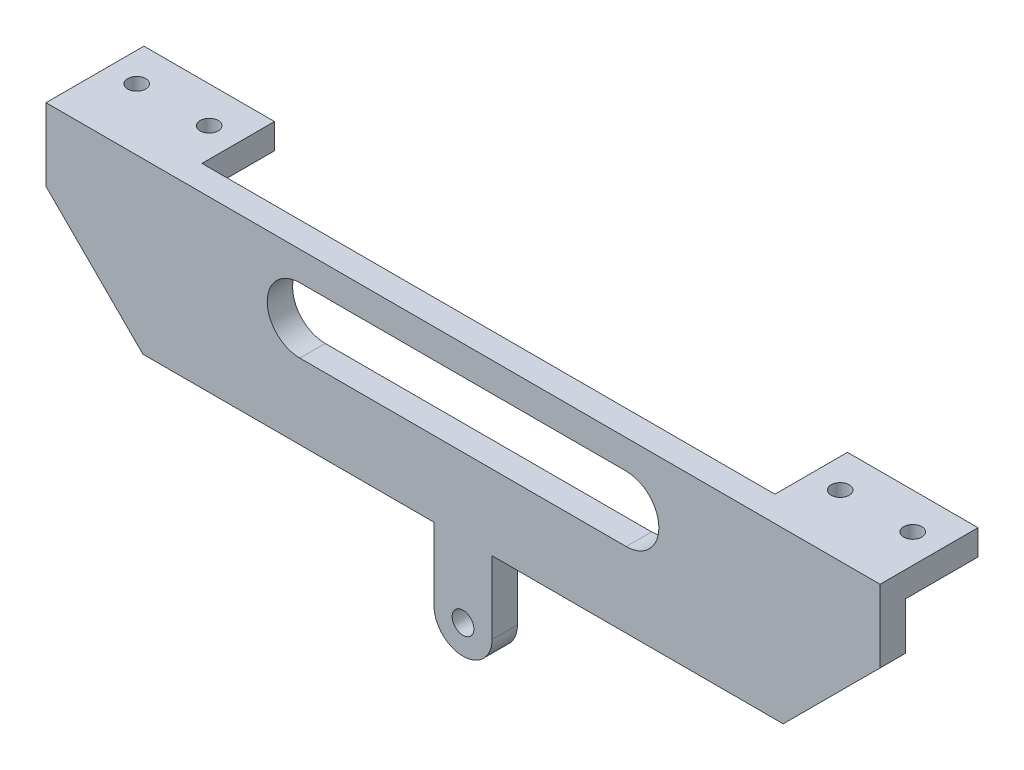
ISO-10303-21;
HEADER;
FILE_DESCRIPTION(('STEP AP214'),'2;1');
FILE_NAME('part.step','',(''),(''),'','','');
FILE_SCHEMA(('AUTOMOTIVE_DESIGN { 1 0 10303 214 1 1 1 1 }'));
ENDSEC;
DATA;
#1=APPLICATION_CONTEXT('core data for automotive mechanical design processes');
#2=APPLICATION_PROTOCOL_DEFINITION('international standard','automotive_design',2000,#1);
#3=PRODUCT_CONTEXT('',#1,'mechanical');
#4=PRODUCT('Part','Part','',(#3));
#5=PRODUCT_RELATED_PRODUCT_CATEGORY('part','',(#4));
#6=PRODUCT_DEFINITION_FORMATION('','',#4);
#7=PRODUCT_DEFINITION_CONTEXT('part definition',#1,'design');
#8=PRODUCT_DEFINITION('design','',#6,#7);
#9=PRODUCT_DEFINITION_SHAPE('','',#8);
#10=(LENGTH_UNIT() NAMED_UNIT(*) SI_UNIT(.MILLI.,.METRE.));
#11=(NAMED_UNIT(*) PLANE_ANGLE_UNIT() SI_UNIT($,.RADIAN.));
#12=(NAMED_UNIT(*) SI_UNIT($,.STERADIAN.) SOLID_ANGLE_UNIT());
#13=UNCERTAINTY_MEASURE_WITH_UNIT(LENGTH_MEASURE(1.E-05),#10,'distance_accuracy_value','');
#14=(GEOMETRIC_REPRESENTATION_CONTEXT(3) GLOBAL_UNCERTAINTY_ASSIGNED_CONTEXT((#13)) GLOBAL_UNIT_ASSIGNED_CONTEXT((#10,
#11,#12)) REPRESENTATION_CONTEXT('',''));
#15=CARTESIAN_POINT('',(0.,0.,0.));
#16=DIRECTION('',(0.,0.,1.));
#17=DIRECTION('',(1.,0.,0.));
#18=AXIS2_PLACEMENT_3D('',#15,#16,#17);
#19=CARTESIAN_POINT('',(0.,60.,0.));
#20=DIRECTION('',(0.,0.,1.));
#21=DIRECTION('',(1.,0.,0.));
#22=AXIS2_PLACEMENT_3D('',#19,#20,#21);
#23=PLANE('',#22);
#24=CARTESIAN_POINT('',(0.,60.,0.));
#25=DIRECTION('',(0.,0.,1.));
#26=DIRECTION('',(1.,0.,0.));
#27=AXIS2_PLACEMENT_3D('',#24,#25,#26);
#28=CIRCLE('',#27,1.5);
#29=CARTESIAN_POINT('',(1.50000000000002,60.,0.));
#30=VERTEX_POINT('',#29);
#31=EDGE_CURVE('E351',#30,#30,#28,.T.);
#32=ORIENTED_EDGE('',*,*,#31,.T.);
#33=EDGE_LOOP('',(#32));
#34=FACE_BOUND('',#33,.T.);
#35=CARTESIAN_POINT('',(-22.5,84.85,0.));
#36=DIRECTION('',(0.,0.,1.));
#37=DIRECTION('',(1.,0.,0.));
#38=AXIS2_PLACEMENT_3D('',#35,#36,#37);
#39=CIRCLE('',#38,4.5);
#40=CARTESIAN_POINT('',(-22.5,89.35,0.));
#41=VERTEX_POINT('',#40);
#42=CARTESIAN_POINT('',(-22.5,80.35,0.));
#43=VERTEX_POINT('',#42);
#44=EDGE_CURVE('E335',#41,#43,#39,.T.);
#45=ORIENTED_EDGE('',*,*,#44,.T.);
#46=DIRECTION('',(1.,0.,0.));
#47=VECTOR('',#46,1.);
#48=CARTESIAN_POINT('',(-22.5,80.35,0.));
#49=LINE('',#48,#47);
#50=CARTESIAN_POINT('',(22.5,80.3500000000001,0.));
#51=VERTEX_POINT('',#50);
#52=EDGE_CURVE('E331',#43,#51,#49,.T.);
#53=ORIENTED_EDGE('',*,*,#52,.T.);
#54=CARTESIAN_POINT('',(22.5,84.85,0.));
#55=DIRECTION('',(0.,0.,1.));
#56=DIRECTION('',(1.,0.,0.));
#57=AXIS2_PLACEMENT_3D('',#54,#55,#56);
#58=CIRCLE('',#57,4.49999999999998);
#59=CARTESIAN_POINT('',(22.5,89.35,0.));
#60=VERTEX_POINT('',#59);
#61=EDGE_CURVE('E327',#51,#60,#58,.T.);
#62=ORIENTED_EDGE('',*,*,#61,.T.);
#63=DIRECTION('',(-1.,0.,0.));
#64=VECTOR('',#63,1.);
#65=CARTESIAN_POINT('',(22.5,89.35,0.));
#66=LINE('',#65,#64);
#67=EDGE_CURVE('E322',#60,#41,#66,.T.);
#68=ORIENTED_EDGE('',*,*,#67,.T.);
#69=EDGE_LOOP('',(#45,#53,#62,#68));
#70=FACE_BOUND('',#69,.T.);
#71=DIRECTION('',(-1.,0.,0.));
#72=VECTOR('',#71,1.);
#73=CARTESIAN_POINT('',(-57.5,93.35,0.));
#74=LINE('',#73,#72);
#75=CARTESIAN_POINT('',(39.5,93.35,0.));
#76=VERTEX_POINT('',#75);
#77=CARTESIAN_POINT('',(-39.5,93.35,0.));
#78=VERTEX_POINT('',#77);
#79=EDGE_CURVE('E62',#76,#78,#74,.T.);
#80=ORIENTED_EDGE('',*,*,#79,.F.);
#81=DIRECTION('',(0.,1.,0.));
#82=VECTOR('',#81,1.);
#83=CARTESIAN_POINT('',(39.5,89.85,0.));
#84=LINE('',#83,#82);
#85=CARTESIAN_POINT('',(39.5,89.85,0.));
#86=VERTEX_POINT('',#85);
#87=EDGE_CURVE('E199',#86,#76,#84,.T.);
#88=ORIENTED_EDGE('',*,*,#87,.F.);
#89=DIRECTION('',(-1.,0.,0.));
#90=VECTOR('',#89,1.);
#91=CARTESIAN_POINT('',(0.,89.85,0.));
#92=LINE('',#91,#90);
#93=CARTESIAN_POINT('',(57.5,89.85,0.));
#94=VERTEX_POINT('',#93);
#95=EDGE_CURVE('E185',#94,#86,#92,.T.);
#96=ORIENTED_EDGE('',*,*,#95,.F.);
#97=DIRECTION('',(0.,1.,0.));
#98=VECTOR('',#97,1.);
#99=CARTESIAN_POINT('',(57.5,93.35,0.));
#100=LINE('',#99,#98);
#101=CARTESIAN_POINT('',(57.5,83.35,0.));
#102=VERTEX_POINT('',#101);
#103=EDGE_CURVE('E198',#102,#94,#100,.T.);
#104=ORIENTED_EDGE('',*,*,#103,.F.);
#105=DIRECTION('',(0.707314964616464,0.70689853644608,0.));
#106=VECTOR('',#105,1.);
#107=CARTESIAN_POINT('',(57.5,83.35,0.));
#108=LINE('',#107,#106);
#109=CARTESIAN_POINT('',(44.142135623731,70.,0.));
#110=VERTEX_POINT('',#109);
#111=EDGE_CURVE('E209',#110,#102,#108,.T.);
#112=ORIENTED_EDGE('',*,*,#111,.F.);
#113=DIRECTION('',(1.,0.,0.));
#114=VECTOR('',#113,1.);
#115=CARTESIAN_POINT('',(4.00000000000002,70.,0.));
#116=LINE('',#115,#114);
#117=CARTESIAN_POINT('',(4.00000000000002,70.,0.));
#118=VERTEX_POINT('',#117);
#119=EDGE_CURVE('E215',#118,#110,#116,.T.);
#120=ORIENTED_EDGE('',*,*,#119,.F.);
#121=DIRECTION('',(0.,1.,0.));
#122=VECTOR('',#121,1.);
#123=CARTESIAN_POINT('',(4.00000000000002,60.,0.));
#124=LINE('',#123,#122);
#125=CARTESIAN_POINT('',(4.00000000000002,60.,0.));
#126=VERTEX_POINT('',#125);
#127=EDGE_CURVE('E270',#126,#118,#124,.T.);
#128=ORIENTED_EDGE('',*,*,#127,.F.);
#129=CARTESIAN_POINT('',(0.,60.,0.));
#130=DIRECTION('',(0.,0.,1.));
#131=DIRECTION('',(1.,0.,0.));
#132=AXIS2_PLACEMENT_3D('',#129,#130,#131);
#133=CIRCLE('',#132,4.);
#134=CARTESIAN_POINT('',(-3.99999999999999,60.,0.));
#135=VERTEX_POINT('',#134);
#136=EDGE_CURVE('E273',#135,#126,#133,.T.);
#137=ORIENTED_EDGE('',*,*,#136,.F.);
#138=DIRECTION('',(0.,-1.,0.));
#139=VECTOR('',#138,1.);
#140=CARTESIAN_POINT('',(-3.99999999999999,60.,0.));
#141=LINE('',#140,#139);
#142=CARTESIAN_POINT('',(-3.99999999999999,70.,0.));
#143=VERTEX_POINT('',#142);
#144=EDGE_CURVE('E227',#143,#135,#141,.T.);
#145=ORIENTED_EDGE('',*,*,#144,.F.);
#146=DIRECTION('',(1.,0.,0.));
#147=VECTOR('',#146,1.);
#148=CARTESIAN_POINT('',(-44.1421356237309,70.,0.));
#149=LINE('',#148,#147);
#150=CARTESIAN_POINT('',(-44.1421356237309,70.,0.));
#151=VERTEX_POINT('',#150);
#152=EDGE_CURVE('E224',#151,#143,#149,.T.);
#153=ORIENTED_EDGE('',*,*,#152,.F.);
#154=DIRECTION('',(0.707314964616465,-0.706898536446079,0.));
#155=VECTOR('',#154,1.);
#156=CARTESIAN_POINT('',(-57.5,83.35,0.));
#157=LINE('',#156,#155);
#158=CARTESIAN_POINT('',(-57.5,83.35,0.));
#159=VERTEX_POINT('',#158);
#160=EDGE_CURVE('E221',#159,#151,#157,.T.);
#161=ORIENTED_EDGE('',*,*,#160,.F.);
#162=DIRECTION('',(0.,-1.,0.));
#163=VECTOR('',#162,1.);
#164=CARTESIAN_POINT('',(-57.5,93.35,0.));
#165=LINE('',#164,#163);
#166=CARTESIAN_POINT('',(-57.5,89.85,0.));
#167=VERTEX_POINT('',#166);
#168=EDGE_CURVE('E213',#167,#159,#165,.T.);
#169=ORIENTED_EDGE('',*,*,#168,.F.);
#170=DIRECTION('',(-1.,0.,0.));
#171=VECTOR('',#170,1.);
#172=CARTESIAN_POINT('',(0.,89.85,0.));
#173=LINE('',#172,#171);
#174=CARTESIAN_POINT('',(-39.5,89.85,0.));
#175=VERTEX_POINT('',#174);
#176=EDGE_CURVE('E364',#175,#167,#173,.T.);
#177=ORIENTED_EDGE('',*,*,#176,.F.);
#178=DIRECTION('',(0.,1.,0.));
#179=VECTOR('',#178,1.);
#180=CARTESIAN_POINT('',(-39.5,89.85,0.));
#181=LINE('',#180,#179);
#182=EDGE_CURVE('E355',#175,#78,#181,.T.);
#183=ORIENTED_EDGE('',*,*,#182,.T.);
#184=EDGE_LOOP('',(#80,#88,#96,#104,#112,#120,#128,#137,#145,#153,#161,#169,#177,#183));
#185=FACE_BOUND('',#184,.T.);
#186=ADVANCED_FACE('F41',(#34,#70,#185),#23,.F.);
#187=CARTESIAN_POINT('',(0.,60.,3.5));
#188=DIRECTION('',(0.,0.,1.));
#189=DIRECTION('',(1.,0.,0.));
#190=AXIS2_PLACEMENT_3D('',#187,#188,#189);
#191=PLANE('',#190);
#192=DIRECTION('',(1.,0.,0.));
#193=VECTOR('',#192,1.);
#194=CARTESIAN_POINT('',(-22.5,80.35,3.5));
#195=LINE('',#194,#193);
#196=CARTESIAN_POINT('',(-22.5,80.35,3.5));
#197=VERTEX_POINT('',#196);
#198=CARTESIAN_POINT('',(22.5,80.3500000000001,3.5));
#199=VERTEX_POINT('',#198);
#200=EDGE_CURVE('E346',#197,#199,#195,.T.);
#201=ORIENTED_EDGE('',*,*,#200,.F.);
#202=CARTESIAN_POINT('',(-22.5,84.85,3.5));
#203=DIRECTION('',(0.,0.,1.));
#204=DIRECTION('',(1.,0.,0.));
#205=AXIS2_PLACEMENT_3D('',#202,#203,#204);
#206=CIRCLE('',#205,4.5);
#207=CARTESIAN_POINT('',(-22.5,89.35,3.5));
#208=VERTEX_POINT('',#207);
#209=EDGE_CURVE('E326',#208,#197,#206,.T.);
#210=ORIENTED_EDGE('',*,*,#209,.F.);
#211=DIRECTION('',(-1.,0.,0.));
#212=VECTOR('',#211,1.);
#213=CARTESIAN_POINT('',(22.5,89.35,3.5));
#214=LINE('',#213,#212);
#215=CARTESIAN_POINT('',(22.5,89.35,3.5));
#216=VERTEX_POINT('',#215);
#217=EDGE_CURVE('E321',#216,#208,#214,.T.);
#218=ORIENTED_EDGE('',*,*,#217,.F.);
#219=CARTESIAN_POINT('',(22.5,84.85,3.5));
#220=DIRECTION('',(0.,0.,1.));
#221=DIRECTION('',(1.,0.,0.));
#222=AXIS2_PLACEMENT_3D('',#219,#220,#221);
#223=CIRCLE('',#222,4.49999999999998);
#224=EDGE_CURVE('E342',#199,#216,#223,.T.);
#225=ORIENTED_EDGE('',*,*,#224,.F.);
#226=EDGE_LOOP('',(#201,#210,#218,#225));
#227=FACE_BOUND('',#226,.T.);
#228=CARTESIAN_POINT('',(0.,60.,3.5));
#229=DIRECTION('',(0.,0.,1.));
#230=DIRECTION('',(1.,0.,0.));
#231=AXIS2_PLACEMENT_3D('',#228,#229,#230);
#232=CIRCLE('',#231,4.);
#233=CARTESIAN_POINT('',(-3.99999999999999,60.,3.5));
#234=VERTEX_POINT('',#233);
#235=CARTESIAN_POINT('',(4.00000000000002,60.,3.5));
#236=VERTEX_POINT('',#235);
#237=EDGE_CURVE('E230',#234,#236,#232,.T.);
#238=ORIENTED_EDGE('',*,*,#237,.T.);
#239=DIRECTION('',(0.,1.,0.));
#240=VECTOR('',#239,1.);
#241=CARTESIAN_POINT('',(4.00000000000002,60.,3.5));
#242=LINE('',#241,#240);
#243=CARTESIAN_POINT('',(4.00000000000002,70.,3.5));
#244=VERTEX_POINT('',#243);
#245=EDGE_CURVE('E302',#236,#244,#242,.T.);
#246=ORIENTED_EDGE('',*,*,#245,.T.);
#247=DIRECTION('',(1.,0.,0.));
#248=VECTOR('',#247,1.);
#249=CARTESIAN_POINT('',(4.00000000000002,70.,3.5));
#250=LINE('',#249,#248);
#251=CARTESIAN_POINT('',(44.142135623731,70.,3.5));
#252=VERTEX_POINT('',#251);
#253=EDGE_CURVE('E267',#244,#252,#250,.T.);
#254=ORIENTED_EDGE('',*,*,#253,.T.);
#255=DIRECTION('',(0.707314964616464,0.70689853644608,0.));
#256=VECTOR('',#255,1.);
#257=CARTESIAN_POINT('',(57.5,83.35,3.5));
#258=LINE('',#257,#256);
#259=CARTESIAN_POINT('',(57.5,83.35,3.5));
#260=VERTEX_POINT('',#259);
#261=EDGE_CURVE('E297',#252,#260,#258,.T.);
#262=ORIENTED_EDGE('',*,*,#261,.T.);
#263=DIRECTION('',(0.,1.,0.));
#264=VECTOR('',#263,1.);
#265=CARTESIAN_POINT('',(57.5,93.35,3.5));
#266=LINE('',#265,#264);
#267=CARTESIAN_POINT('',(57.5,93.35,3.5));
#268=VERTEX_POINT('',#267);
#269=EDGE_CURVE('E294',#260,#268,#266,.T.);
#270=ORIENTED_EDGE('',*,*,#269,.T.);
#271=DIRECTION('',(-1.,0.,0.));
#272=VECTOR('',#271,1.);
#273=CARTESIAN_POINT('',(-57.5,93.35,3.5));
#274=LINE('',#273,#272);
#275=CARTESIAN_POINT('',(-57.5,93.35,3.5));
#276=VERTEX_POINT('',#275);
#277=EDGE_CURVE('E291',#268,#276,#274,.T.);
#278=ORIENTED_EDGE('',*,*,#277,.T.);
#279=DIRECTION('',(0.,-1.,0.));
#280=VECTOR('',#279,1.);
#281=CARTESIAN_POINT('',(-57.5,93.35,3.5));
#282=LINE('',#281,#280);
#283=CARTESIAN_POINT('',(-57.5,83.35,3.5));
#284=VERTEX_POINT('',#283);
#285=EDGE_CURVE('E288',#276,#284,#282,.T.);
#286=ORIENTED_EDGE('',*,*,#285,.T.);
#287=DIRECTION('',(0.707314964616465,-0.706898536446079,0.));
#288=VECTOR('',#287,1.);
#289=CARTESIAN_POINT('',(-57.5,83.35,3.5));
#290=LINE('',#289,#288);
#291=CARTESIAN_POINT('',(-44.1421356237309,70.,3.5));
#292=VERTEX_POINT('',#291);
#293=EDGE_CURVE('E285',#284,#292,#290,.T.);
#294=ORIENTED_EDGE('',*,*,#293,.T.);
#295=DIRECTION('',(1.,0.,0.));
#296=VECTOR('',#295,1.);
#297=CARTESIAN_POINT('',(-44.1421356237309,70.,3.5));
#298=LINE('',#297,#296);
#299=CARTESIAN_POINT('',(-3.99999999999999,70.,3.5));
#300=VERTEX_POINT('',#299);
#301=EDGE_CURVE('E282',#292,#300,#298,.T.);
#302=ORIENTED_EDGE('',*,*,#301,.T.);
#303=DIRECTION('',(0.,-1.,0.));
#304=VECTOR('',#303,1.);
#305=CARTESIAN_POINT('',(-3.99999999999999,60.,3.5));
#306=LINE('',#305,#304);
#307=EDGE_CURVE('E236',#300,#234,#306,.T.);
#308=ORIENTED_EDGE('',*,*,#307,.T.);
#309=EDGE_LOOP('',(#238,#246,#254,#262,#270,#278,#286,#294,#302,#308));
#310=FACE_BOUND('',#309,.T.);
#311=CARTESIAN_POINT('',(0.,60.,3.5));
#312=DIRECTION('',(0.,0.,1.));
#313=DIRECTION('',(1.,0.,0.));
#314=AXIS2_PLACEMENT_3D('',#311,#312,#313);
#315=CIRCLE('',#314,1.5);
#316=CARTESIAN_POINT('',(1.50000000000002,60.,3.5));
#317=VERTEX_POINT('',#316);
#318=EDGE_CURVE('E339',#317,#317,#315,.T.);
#319=ORIENTED_EDGE('',*,*,#318,.F.);
#320=EDGE_LOOP('',(#319));
#321=FACE_BOUND('',#320,.T.);
#322=ADVANCED_FACE('F450',(#227,#310,#321),#191,.T.);
#323=CARTESIAN_POINT('',(0.,60.,3.5));
#324=DIRECTION('',(0.,0.,-1.));
#325=DIRECTION('',(-1.,0.,0.));
#326=AXIS2_PLACEMENT_3D('',#323,#324,#325);
#327=CYLINDRICAL_SURFACE('',#326,4.);
#328=ORIENTED_EDGE('',*,*,#136,.T.);
#329=DIRECTION('',(0.,0.,-1.));
#330=VECTOR('',#329,1.);
#331=CARTESIAN_POINT('',(4.00000000000002,60.,3.5));
#332=LINE('',#331,#330);
#333=EDGE_CURVE('E11',#236,#126,#332,.T.);
#334=ORIENTED_EDGE('',*,*,#333,.F.);
#335=ORIENTED_EDGE('',*,*,#237,.F.);
#336=DIRECTION('',(0.,0.,-1.));
#337=VECTOR('',#336,1.);
#338=CARTESIAN_POINT('',(-3.99999999999999,60.,3.5));
#339=LINE('',#338,#337);
#340=EDGE_CURVE('E231',#234,#135,#339,.T.);
#341=ORIENTED_EDGE('',*,*,#340,.T.);
#342=EDGE_LOOP('',(#328,#334,#335,#341));
#343=FACE_BOUND('',#342,.T.);
#344=ADVANCED_FACE('F43',(#343),#327,.T.);
#345=CARTESIAN_POINT('',(4.00000000000002,60.,3.5));
#346=DIRECTION('',(-1.,0.,0.));
#347=DIRECTION('',(0.,-1.,0.));
#348=AXIS2_PLACEMENT_3D('',#345,#346,#347);
#349=PLANE('',#348);
#350=ORIENTED_EDGE('',*,*,#127,.T.);
#351=DIRECTION('',(0.,0.,-1.));
#352=VECTOR('',#351,1.);
#353=CARTESIAN_POINT('',(4.00000000000002,70.,3.5));
#354=LINE('',#353,#352);
#355=EDGE_CURVE('E50',#244,#118,#354,.T.);
#356=ORIENTED_EDGE('',*,*,#355,.F.);
#357=ORIENTED_EDGE('',*,*,#245,.F.);
#358=ORIENTED_EDGE('',*,*,#333,.T.);
#359=EDGE_LOOP('',(#350,#356,#357,#358));
#360=FACE_BOUND('',#359,.T.);
#361=ADVANCED_FACE('F488',(#360),#349,.F.);
#362=CARTESIAN_POINT('',(4.00000000000002,70.,3.5));
#363=DIRECTION('',(0.,1.,0.));
#364=DIRECTION('',(0.,0.,1.));
#365=AXIS2_PLACEMENT_3D('',#362,#363,#364);
#366=PLANE('',#365);
#367=ORIENTED_EDGE('',*,*,#119,.T.);
#368=DIRECTION('',(0.,0.,-1.));
#369=VECTOR('',#368,1.);
#370=CARTESIAN_POINT('',(44.142135623731,70.,3.5));
#371=LINE('',#370,#369);
#372=EDGE_CURVE('E256',#252,#110,#371,.T.);
#373=ORIENTED_EDGE('',*,*,#372,.F.);
#374=ORIENTED_EDGE('',*,*,#253,.F.);
#375=ORIENTED_EDGE('',*,*,#355,.T.);
#376=EDGE_LOOP('',(#367,#373,#374,#375));
#377=FACE_BOUND('',#376,.T.);
#378=ADVANCED_FACE('F265',(#377),#366,.F.);
#379=CARTESIAN_POINT('',(57.5,83.35,3.5));
#380=DIRECTION('',(-0.70689853644608,0.707314964616464,0.));
#381=DIRECTION('',(-0.707314964616464,-0.70689853644608,0.));
#382=AXIS2_PLACEMENT_3D('',#379,#380,#381);
#383=PLANE('',#382);
#384=ORIENTED_EDGE('',*,*,#111,.T.);
#385=DIRECTION('',(0.,0.,-1.));
#386=VECTOR('',#385,1.);
#387=CARTESIAN_POINT('',(57.5,83.35,3.5));
#388=LINE('',#387,#386);
#389=EDGE_CURVE('E207',#260,#102,#388,.T.);
#390=ORIENTED_EDGE('',*,*,#389,.F.);
#391=ORIENTED_EDGE('',*,*,#261,.F.);
#392=ORIENTED_EDGE('',*,*,#372,.T.);
#393=EDGE_LOOP('',(#384,#390,#391,#392));
#394=FACE_BOUND('',#393,.T.);
#395=ADVANCED_FACE('F483',(#394),#383,.F.);
#396=CARTESIAN_POINT('',(57.5,93.35,3.5));
#397=DIRECTION('',(-1.,0.,0.));
#398=DIRECTION('',(0.,0.,1.));
#399=AXIS2_PLACEMENT_3D('',#396,#397,#398);
#400=PLANE('',#399);
#401=ORIENTED_EDGE('',*,*,#103,.T.);
#402=DIRECTION('',(0.,0.,-1.));
#403=VECTOR('',#402,1.);
#404=CARTESIAN_POINT('',(57.5,89.85,0.));
#405=LINE('',#404,#403);
#406=CARTESIAN_POINT('',(57.5,89.85,-9.99999999999999));
#407=VERTEX_POINT('',#406);
#408=EDGE_CURVE('E180',#94,#407,#405,.T.);
#409=ORIENTED_EDGE('',*,*,#408,.T.);
#410=DIRECTION('',(0.,1.,0.));
#411=VECTOR('',#410,1.);
#412=CARTESIAN_POINT('',(57.5,89.85,-9.99999999999999));
#413=LINE('',#412,#411);
#414=CARTESIAN_POINT('',(57.5,93.35,-9.99999999999999));
#415=VERTEX_POINT('',#414);
#416=EDGE_CURVE('E404',#407,#415,#413,.T.);
#417=ORIENTED_EDGE('',*,*,#416,.T.);
#418=DIRECTION('',(0.,0.,-1.));
#419=VECTOR('',#418,1.);
#420=CARTESIAN_POINT('',(57.5,93.35,3.5));
#421=LINE('',#420,#419);
#422=EDGE_CURVE('E251',#268,#415,#421,.T.);
#423=ORIENTED_EDGE('',*,*,#422,.F.);
#424=ORIENTED_EDGE('',*,*,#269,.F.);
#425=ORIENTED_EDGE('',*,*,#389,.T.);
#426=EDGE_LOOP('',(#401,#409,#417,#423,#424,#425));
#427=FACE_BOUND('',#426,.T.);
#428=ADVANCED_FACE('F204',(#427),#400,.F.);
#429=CARTESIAN_POINT('',(-57.5,93.35,3.5));
#430=DIRECTION('',(0.,-1.,0.));
#431=DIRECTION('',(0.,0.,-1.));
#432=AXIS2_PLACEMENT_3D('',#429,#430,#431);
#433=PLANE('',#432);
#434=ORIENTED_EDGE('',*,*,#422,.T.);
#435=DIRECTION('',(-1.,0.,0.));
#436=VECTOR('',#435,1.);
#437=CARTESIAN_POINT('',(0.,93.35,-9.99999999999999));
#438=LINE('',#437,#436);
#439=CARTESIAN_POINT('',(39.5,93.35,-9.99999999999999));
#440=VERTEX_POINT('',#439);
#441=EDGE_CURVE('E419',#415,#440,#438,.T.);
#442=ORIENTED_EDGE('',*,*,#441,.T.);
#443=DIRECTION('',(0.,0.,1.));
#444=VECTOR('',#443,1.);
#445=CARTESIAN_POINT('',(39.5,93.35,0.));
#446=LINE('',#445,#444);
#447=EDGE_CURVE('E57',#440,#76,#446,.T.);
#448=ORIENTED_EDGE('',*,*,#447,.T.);
#449=ORIENTED_EDGE('',*,*,#79,.T.);
#450=DIRECTION('',(0.,0.,1.));
#451=VECTOR('',#450,1.);
#452=CARTESIAN_POINT('',(-39.5,93.35,0.));
#453=LINE('',#452,#451);
#454=CARTESIAN_POINT('',(-39.5,93.35,-10.));
#455=VERTEX_POINT('',#454);
#456=EDGE_CURVE('E375',#455,#78,#453,.T.);
#457=ORIENTED_EDGE('',*,*,#456,.F.);
#458=DIRECTION('',(1.,0.,0.));
#459=VECTOR('',#458,1.);
#460=CARTESIAN_POINT('',(0.,93.35,-10.));
#461=LINE('',#460,#459);
#462=CARTESIAN_POINT('',(-57.5,93.35,-10.));
#463=VERTEX_POINT('',#462);
#464=EDGE_CURVE('E371',#463,#455,#461,.T.);
#465=ORIENTED_EDGE('',*,*,#464,.F.);
#466=DIRECTION('',(0.,0.,-1.));
#467=VECTOR('',#466,1.);
#468=CARTESIAN_POINT('',(-57.5,93.35,3.5));
#469=LINE('',#468,#467);
#470=EDGE_CURVE('E248',#276,#463,#469,.T.);
#471=ORIENTED_EDGE('',*,*,#470,.F.);
#472=ORIENTED_EDGE('',*,*,#277,.F.);
#473=EDGE_LOOP('',(#434,#442,#448,#449,#457,#465,#471,#472));
#474=FACE_BOUND('',#473,.T.);
#475=CARTESIAN_POINT('',(-43.5,93.35,-5.));
#476=DIRECTION('',(0.,1.,0.));
#477=DIRECTION('',(0.,0.,1.));
#478=AXIS2_PLACEMENT_3D('',#475,#476,#477);
#479=CIRCLE('',#478,1.25);
#480=CARTESIAN_POINT('',(-43.5,93.35,-3.75));
#481=VERTEX_POINT('',#480);
#482=EDGE_CURVE('E382',#481,#481,#479,.T.);
#483=ORIENTED_EDGE('',*,*,#482,.F.);
#484=EDGE_LOOP('',(#483));
#485=FACE_BOUND('',#484,.T.);
#486=CARTESIAN_POINT('',(-53.5,93.35,-5.));
#487=DIRECTION('',(0.,1.,0.));
#488=DIRECTION('',(0.,0.,1.));
#489=AXIS2_PLACEMENT_3D('',#486,#487,#488);
#490=CIRCLE('',#489,1.25);
#491=CARTESIAN_POINT('',(-53.5,93.35,-3.75));
#492=VERTEX_POINT('',#491);
#493=EDGE_CURVE('E378',#492,#492,#490,.T.);
#494=ORIENTED_EDGE('',*,*,#493,.F.);
#495=EDGE_LOOP('',(#494));
#496=FACE_BOUND('',#495,.T.);
#497=CARTESIAN_POINT('',(43.5,93.35,-5.));
#498=DIRECTION('',(0.,1.,0.));
#499=DIRECTION('',(0.,0.,1.));
#500=AXIS2_PLACEMENT_3D('',#497,#498,#499);
#501=CIRCLE('',#500,1.25);
#502=CARTESIAN_POINT('',(43.5,93.35,-3.75));
#503=VERTEX_POINT('',#502);
#504=EDGE_CURVE('E422',#503,#503,#501,.F.);
#505=ORIENTED_EDGE('',*,*,#504,.T.);
#506=EDGE_LOOP('',(#505));
#507=FACE_BOUND('',#506,.T.);
#508=CARTESIAN_POINT('',(53.5,93.35,-5.));
#509=DIRECTION('',(0.,1.,0.));
#510=DIRECTION('',(0.,0.,1.));
#511=AXIS2_PLACEMENT_3D('',#508,#509,#510);
#512=CIRCLE('',#511,1.25);
#513=CARTESIAN_POINT('',(53.5,93.35,-3.75));
#514=VERTEX_POINT('',#513);
#515=EDGE_CURVE('E413',#514,#514,#512,.F.);
#516=ORIENTED_EDGE('',*,*,#515,.T.);
#517=EDGE_LOOP('',(#516));
#518=FACE_BOUND('',#517,.T.);
#519=ADVANCED_FACE('F477',(#474,#485,#496,#507,#518),#433,.F.);
#520=CARTESIAN_POINT('',(-57.5,93.35,3.5));
#521=DIRECTION('',(1.,0.,0.));
#522=DIRECTION('',(0.,0.,-1.));
#523=AXIS2_PLACEMENT_3D('',#520,#521,#522);
#524=PLANE('',#523);
#525=ORIENTED_EDGE('',*,*,#470,.T.);
#526=DIRECTION('',(0.,1.,0.));
#527=VECTOR('',#526,1.);
#528=CARTESIAN_POINT('',(-57.5,89.85,-10.));
#529=LINE('',#528,#527);
#530=CARTESIAN_POINT('',(-57.5,89.85,-10.));
#531=VERTEX_POINT('',#530);
#532=EDGE_CURVE('E363',#531,#463,#529,.T.);
#533=ORIENTED_EDGE('',*,*,#532,.F.);
#534=DIRECTION('',(0.,0.,-1.));
#535=VECTOR('',#534,1.);
#536=CARTESIAN_POINT('',(-57.5,89.85,0.));
#537=LINE('',#536,#535);
#538=EDGE_CURVE('E388',#167,#531,#537,.T.);
#539=ORIENTED_EDGE('',*,*,#538,.F.);
#540=ORIENTED_EDGE('',*,*,#168,.T.);
#541=DIRECTION('',(0.,0.,-1.));
#542=VECTOR('',#541,1.);
#543=CARTESIAN_POINT('',(-57.5,83.35,3.5));
#544=LINE('',#543,#542);
#545=EDGE_CURVE('E244',#284,#159,#544,.T.);
#546=ORIENTED_EDGE('',*,*,#545,.F.);
#547=ORIENTED_EDGE('',*,*,#285,.F.);
#548=EDGE_LOOP('',(#525,#533,#539,#540,#546,#547));
#549=FACE_BOUND('',#548,.T.);
#550=ADVANCED_FACE('F473',(#549),#524,.F.);
#551=CARTESIAN_POINT('',(-57.5,83.35,3.5));
#552=DIRECTION('',(0.706898536446079,0.707314964616465,0.));
#553=DIRECTION('',(-0.707314964616465,0.706898536446079,0.));
#554=AXIS2_PLACEMENT_3D('',#551,#552,#553);
#555=PLANE('',#554);
#556=ORIENTED_EDGE('',*,*,#160,.T.);
#557=DIRECTION('',(0.,0.,-1.));
#558=VECTOR('',#557,1.);
#559=CARTESIAN_POINT('',(-44.1421356237309,70.,3.5));
#560=LINE('',#559,#558);
#561=EDGE_CURVE('E240',#292,#151,#560,.T.);
#562=ORIENTED_EDGE('',*,*,#561,.F.);
#563=ORIENTED_EDGE('',*,*,#293,.F.);
#564=ORIENTED_EDGE('',*,*,#545,.T.);
#565=EDGE_LOOP('',(#556,#562,#563,#564));
#566=FACE_BOUND('',#565,.T.);
#567=ADVANCED_FACE('F469',(#566),#555,.F.);
#568=CARTESIAN_POINT('',(-44.1421356237309,70.,3.5));
#569=DIRECTION('',(0.,1.,0.));
#570=DIRECTION('',(0.,0.,1.));
#571=AXIS2_PLACEMENT_3D('',#568,#569,#570);
#572=PLANE('',#571);
#573=ORIENTED_EDGE('',*,*,#152,.T.);
#574=DIRECTION('',(0.,0.,-1.));
#575=VECTOR('',#574,1.);
#576=CARTESIAN_POINT('',(-3.99999999999999,70.,3.5));
#577=LINE('',#576,#575);
#578=EDGE_CURVE('E235',#300,#143,#577,.T.);
#579=ORIENTED_EDGE('',*,*,#578,.F.);
#580=ORIENTED_EDGE('',*,*,#301,.F.);
#581=ORIENTED_EDGE('',*,*,#561,.T.);
#582=EDGE_LOOP('',(#573,#579,#580,#581));
#583=FACE_BOUND('',#582,.T.);
#584=ADVANCED_FACE('F465',(#583),#572,.F.);
#585=CARTESIAN_POINT('',(-3.99999999999999,60.,3.5));
#586=DIRECTION('',(1.,0.,0.));
#587=DIRECTION('',(0.,1.,0.));
#588=AXIS2_PLACEMENT_3D('',#585,#586,#587);
#589=PLANE('',#588);
#590=ORIENTED_EDGE('',*,*,#144,.T.);
#591=ORIENTED_EDGE('',*,*,#340,.F.);
#592=ORIENTED_EDGE('',*,*,#307,.F.);
#593=ORIENTED_EDGE('',*,*,#578,.T.);
#594=EDGE_LOOP('',(#590,#591,#592,#593));
#595=FACE_BOUND('',#594,.T.);
#596=ADVANCED_FACE('F461',(#595),#589,.F.);
#597=CARTESIAN_POINT('',(-22.5,84.85,3.5));
#598=DIRECTION('',(0.,0.,-1.));
#599=DIRECTION('',(-1.,0.,0.));
#600=AXIS2_PLACEMENT_3D('',#597,#598,#599);
#601=CYLINDRICAL_SURFACE('',#600,4.5);
#602=ORIENTED_EDGE('',*,*,#44,.F.);
#603=DIRECTION('',(0.,0.,-1.));
#604=VECTOR('',#603,1.);
#605=CARTESIAN_POINT('',(-22.5,89.35,3.5));
#606=LINE('',#605,#604);
#607=EDGE_CURVE('E317',#208,#41,#606,.T.);
#608=ORIENTED_EDGE('',*,*,#607,.F.);
#609=ORIENTED_EDGE('',*,*,#209,.T.);
#610=DIRECTION('',(0.,0.,-1.));
#611=VECTOR('',#610,1.);
#612=CARTESIAN_POINT('',(-22.5,80.35,3.5));
#613=LINE('',#612,#611);
#614=EDGE_CURVE('E279',#197,#43,#613,.T.);
#615=ORIENTED_EDGE('',*,*,#614,.T.);
#616=EDGE_LOOP('',(#602,#608,#609,#615));
#617=FACE_BOUND('',#616,.T.);
#618=ADVANCED_FACE('F464',(#617),#601,.F.);
#619=CARTESIAN_POINT('',(-22.5,80.35,3.5));
#620=DIRECTION('',(0.,1.,0.));
#621=DIRECTION('',(-1.,0.,0.));
#622=AXIS2_PLACEMENT_3D('',#619,#620,#621);
#623=PLANE('',#622);
#624=ORIENTED_EDGE('',*,*,#52,.F.);
#625=ORIENTED_EDGE('',*,*,#614,.F.);
#626=ORIENTED_EDGE('',*,*,#200,.T.);
#627=DIRECTION('',(0.,0.,-1.));
#628=VECTOR('',#627,1.);
#629=CARTESIAN_POINT('',(22.5,80.3500000000001,3.5));
#630=LINE('',#629,#628);
#631=EDGE_CURVE('E311',#199,#51,#630,.T.);
#632=ORIENTED_EDGE('',*,*,#631,.T.);
#633=EDGE_LOOP('',(#624,#625,#626,#632));
#634=FACE_BOUND('',#633,.T.);
#635=ADVANCED_FACE('F556',(#634),#623,.T.);
#636=CARTESIAN_POINT('',(22.5,84.85,3.5));
#637=DIRECTION('',(0.,0.,-1.));
#638=DIRECTION('',(-1.,0.,0.));
#639=AXIS2_PLACEMENT_3D('',#636,#637,#638);
#640=CYLINDRICAL_SURFACE('',#639,4.49999999999998);
#641=ORIENTED_EDGE('',*,*,#61,.F.);
#642=ORIENTED_EDGE('',*,*,#631,.F.);
#643=ORIENTED_EDGE('',*,*,#224,.T.);
#644=DIRECTION('',(0.,0.,-1.));
#645=VECTOR('',#644,1.);
#646=CARTESIAN_POINT('',(22.5,89.35,3.5));
#647=LINE('',#646,#645);
#648=EDGE_CURVE('E314',#216,#60,#647,.T.);
#649=ORIENTED_EDGE('',*,*,#648,.T.);
#650=EDGE_LOOP('',(#641,#642,#643,#649));
#651=FACE_BOUND('',#650,.T.);
#652=ADVANCED_FACE('F552',(#651),#640,.F.);
#653=CARTESIAN_POINT('',(22.5,89.35,3.5));
#654=DIRECTION('',(0.,-1.,0.));
#655=DIRECTION('',(1.,0.,0.));
#656=AXIS2_PLACEMENT_3D('',#653,#654,#655);
#657=PLANE('',#656);
#658=ORIENTED_EDGE('',*,*,#67,.F.);
#659=ORIENTED_EDGE('',*,*,#648,.F.);
#660=ORIENTED_EDGE('',*,*,#217,.T.);
#661=ORIENTED_EDGE('',*,*,#607,.T.);
#662=EDGE_LOOP('',(#658,#659,#660,#661));
#663=FACE_BOUND('',#662,.T.);
#664=ADVANCED_FACE('F548',(#663),#657,.T.);
#665=CARTESIAN_POINT('',(0.,60.,3.5));
#666=DIRECTION('',(0.,0.,-1.));
#667=DIRECTION('',(-1.,0.,0.));
#668=AXIS2_PLACEMENT_3D('',#665,#666,#667);
#669=CYLINDRICAL_SURFACE('',#668,1.5);
#670=ORIENTED_EDGE('',*,*,#318,.T.);
#671=EDGE_LOOP('',(#670));
#672=FACE_BOUND('',#671,.T.);
#673=ORIENTED_EDGE('',*,*,#31,.F.);
#674=EDGE_LOOP('',(#673));
#675=FACE_BOUND('',#674,.T.);
#676=ADVANCED_FACE('F542',(#672,#675),#669,.F.);
#677=CARTESIAN_POINT('',(-39.5,89.85,0.));
#678=DIRECTION('',(-1.,0.,0.));
#679=DIRECTION('',(0.,0.,1.));
#680=AXIS2_PLACEMENT_3D('',#677,#678,#679);
#681=PLANE('',#680);
#682=ORIENTED_EDGE('',*,*,#456,.T.);
#683=ORIENTED_EDGE('',*,*,#182,.F.);
#684=DIRECTION('',(0.,0.,1.));
#685=VECTOR('',#684,1.);
#686=CARTESIAN_POINT('',(-39.5,89.85,0.));
#687=LINE('',#686,#685);
#688=CARTESIAN_POINT('',(-39.5,89.85,-10.));
#689=VERTEX_POINT('',#688);
#690=EDGE_CURVE('E394',#689,#175,#687,.T.);
#691=ORIENTED_EDGE('',*,*,#690,.F.);
#692=DIRECTION('',(0.,1.,0.));
#693=VECTOR('',#692,1.);
#694=CARTESIAN_POINT('',(-39.5,89.85,-10.));
#695=LINE('',#694,#693);
#696=EDGE_CURVE('E359',#689,#455,#695,.T.);
#697=ORIENTED_EDGE('',*,*,#696,.T.);
#698=EDGE_LOOP('',(#682,#683,#691,#697));
#699=FACE_BOUND('',#698,.T.);
#700=ADVANCED_FACE('F518',(#699),#681,.F.);
#701=CARTESIAN_POINT('',(-53.5,89.85,-5.));
#702=DIRECTION('',(0.,1.,0.));
#703=DIRECTION('',(0.,0.,1.));
#704=AXIS2_PLACEMENT_3D('',#701,#702,#703);
#705=CYLINDRICAL_SURFACE('',#704,1.25);
#706=CARTESIAN_POINT('',(-53.5,89.85,-5.));
#707=DIRECTION('',(0.,1.,0.));
#708=DIRECTION('',(0.,0.,1.));
#709=AXIS2_PLACEMENT_3D('',#706,#707,#708);
#710=CIRCLE('',#709,1.25);
#711=CARTESIAN_POINT('',(-53.5,89.85,-3.75));
#712=VERTEX_POINT('',#711);
#713=EDGE_CURVE('E397',#712,#712,#710,.T.);
#714=ORIENTED_EDGE('',*,*,#713,.F.);
#715=EDGE_LOOP('',(#714));
#716=FACE_BOUND('',#715,.T.);
#717=ORIENTED_EDGE('',*,*,#493,.T.);
#718=EDGE_LOOP('',(#717));
#719=FACE_BOUND('',#718,.T.);
#720=ADVANCED_FACE('F535',(#716,#719),#705,.F.);
#721=CARTESIAN_POINT('',(-43.5,89.85,-5.));
#722=DIRECTION('',(0.,1.,0.));
#723=DIRECTION('',(0.,0.,1.));
#724=AXIS2_PLACEMENT_3D('',#721,#722,#723);
#725=CYLINDRICAL_SURFACE('',#724,1.25);
#726=CARTESIAN_POINT('',(-43.5,89.85,-5.));
#727=DIRECTION('',(0.,1.,0.));
#728=DIRECTION('',(0.,0.,1.));
#729=AXIS2_PLACEMENT_3D('',#726,#727,#728);
#730=CIRCLE('',#729,1.25);
#731=CARTESIAN_POINT('',(-43.5,89.85,-3.75));
#732=VERTEX_POINT('',#731);
#733=EDGE_CURVE('E374',#732,#732,#730,.T.);
#734=ORIENTED_EDGE('',*,*,#733,.F.);
#735=EDGE_LOOP('',(#734));
#736=FACE_BOUND('',#735,.T.);
#737=ORIENTED_EDGE('',*,*,#482,.T.);
#738=EDGE_LOOP('',(#737));
#739=FACE_BOUND('',#738,.T.);
#740=ADVANCED_FACE('F526',(#736,#739),#725,.F.);
#741=CARTESIAN_POINT('',(0.,89.85,-10.));
#742=DIRECTION('',(0.,0.,1.));
#743=DIRECTION('',(1.,0.,0.));
#744=AXIS2_PLACEMENT_3D('',#741,#742,#743);
#745=PLANE('',#744);
#746=ORIENTED_EDGE('',*,*,#464,.T.);
#747=ORIENTED_EDGE('',*,*,#696,.F.);
#748=DIRECTION('',(1.,0.,0.));
#749=VECTOR('',#748,1.);
#750=CARTESIAN_POINT('',(0.,89.85,-10.));
#751=LINE('',#750,#749);
#752=EDGE_CURVE('E391',#531,#689,#751,.T.);
#753=ORIENTED_EDGE('',*,*,#752,.F.);
#754=ORIENTED_EDGE('',*,*,#532,.T.);
#755=EDGE_LOOP('',(#746,#747,#753,#754));
#756=FACE_BOUND('',#755,.T.);
#757=ADVANCED_FACE('F524',(#756),#745,.F.);
#758=CARTESIAN_POINT('',(0.,89.85,0.));
#759=DIRECTION('',(0.,1.,0.));
#760=DIRECTION('',(0.,0.,1.));
#761=AXIS2_PLACEMENT_3D('',#758,#759,#760);
#762=PLANE('',#761);
#763=ORIENTED_EDGE('',*,*,#733,.T.);
#764=EDGE_LOOP('',(#763));
#765=FACE_BOUND('',#764,.T.);
#766=ORIENTED_EDGE('',*,*,#713,.T.);
#767=EDGE_LOOP('',(#766));
#768=FACE_BOUND('',#767,.T.);
#769=ORIENTED_EDGE('',*,*,#690,.T.);
#770=ORIENTED_EDGE('',*,*,#176,.T.);
#771=ORIENTED_EDGE('',*,*,#538,.T.);
#772=ORIENTED_EDGE('',*,*,#752,.T.);
#773=EDGE_LOOP('',(#769,#770,#771,#772));
#774=FACE_BOUND('',#773,.T.);
#775=ADVANCED_FACE('F513',(#765,#768,#774),#762,.F.);
#776=CARTESIAN_POINT('',(39.5,89.85,0.));
#777=DIRECTION('',(-1.,0.,0.));
#778=DIRECTION('',(0.,0.,1.));
#779=AXIS2_PLACEMENT_3D('',#776,#777,#778);
#780=PLANE('',#779);
#781=ORIENTED_EDGE('',*,*,#447,.F.);
#782=DIRECTION('',(0.,1.,0.));
#783=VECTOR('',#782,1.);
#784=CARTESIAN_POINT('',(39.5,89.85,-9.99999999999999));
#785=LINE('',#784,#783);
#786=CARTESIAN_POINT('',(39.5,89.85,-9.99999999999999));
#787=VERTEX_POINT('',#786);
#788=EDGE_CURVE('E407',#787,#440,#785,.T.);
#789=ORIENTED_EDGE('',*,*,#788,.F.);
#790=DIRECTION('',(0.,0.,1.));
#791=VECTOR('',#790,1.);
#792=CARTESIAN_POINT('',(39.5,89.85,0.));
#793=LINE('',#792,#791);
#794=EDGE_CURVE('E429',#787,#86,#793,.T.);
#795=ORIENTED_EDGE('',*,*,#794,.T.);
#796=ORIENTED_EDGE('',*,*,#87,.T.);
#797=EDGE_LOOP('',(#781,#789,#795,#796));
#798=FACE_BOUND('',#797,.T.);
#799=ADVANCED_FACE('F532',(#798),#780,.T.);
#800=CARTESIAN_POINT('',(0.,89.85,-9.99999999999999));
#801=DIRECTION('',(0.,0.,-1.));
#802=DIRECTION('',(-1.,0.,0.));
#803=AXIS2_PLACEMENT_3D('',#800,#801,#802);
#804=PLANE('',#803);
#805=ORIENTED_EDGE('',*,*,#441,.F.);
#806=ORIENTED_EDGE('',*,*,#416,.F.);
#807=DIRECTION('',(-1.,0.,0.));
#808=VECTOR('',#807,1.);
#809=CARTESIAN_POINT('',(0.,89.85,-9.99999999999999));
#810=LINE('',#809,#808);
#811=EDGE_CURVE('E188',#407,#787,#810,.T.);
#812=ORIENTED_EDGE('',*,*,#811,.T.);
#813=ORIENTED_EDGE('',*,*,#788,.T.);
#814=EDGE_LOOP('',(#805,#806,#812,#813));
#815=FACE_BOUND('',#814,.T.);
#816=ADVANCED_FACE('F581',(#815),#804,.T.);
#817=CARTESIAN_POINT('',(43.5,89.85,-5.));
#818=DIRECTION('',(0.,1.,0.));
#819=DIRECTION('',(0.,0.,1.));
#820=AXIS2_PLACEMENT_3D('',#817,#818,#819);
#821=CYLINDRICAL_SURFACE('',#820,1.25);
#822=CARTESIAN_POINT('',(43.5,89.85,-5.));
#823=DIRECTION('',(0.,1.,0.));
#824=DIRECTION('',(0.,0.,1.));
#825=AXIS2_PLACEMENT_3D('',#822,#823,#824);
#826=CIRCLE('',#825,1.25);
#827=CARTESIAN_POINT('',(43.5,89.85,-3.75));
#828=VERTEX_POINT('',#827);
#829=EDGE_CURVE('E201',#828,#828,#826,.F.);
#830=ORIENTED_EDGE('',*,*,#829,.T.);
#831=EDGE_LOOP('',(#830));
#832=FACE_BOUND('',#831,.T.);
#833=ORIENTED_EDGE('',*,*,#504,.F.);
#834=EDGE_LOOP('',(#833));
#835=FACE_BOUND('',#834,.T.);
#836=ADVANCED_FACE('F438',(#832,#835),#821,.F.);
#837=CARTESIAN_POINT('',(53.5,89.85,-5.));
#838=DIRECTION('',(0.,1.,0.));
#839=DIRECTION('',(0.,0.,1.));
#840=AXIS2_PLACEMENT_3D('',#837,#838,#839);
#841=CYLINDRICAL_SURFACE('',#840,1.25);
#842=CARTESIAN_POINT('',(53.5,89.85,-5.));
#843=DIRECTION('',(0.,1.,0.));
#844=DIRECTION('',(0.,0.,1.));
#845=AXIS2_PLACEMENT_3D('',#842,#843,#844);
#846=CIRCLE('',#845,1.25);
#847=CARTESIAN_POINT('',(53.5,89.85,-3.75));
#848=VERTEX_POINT('',#847);
#849=EDGE_CURVE('E408',#848,#848,#846,.F.);
#850=ORIENTED_EDGE('',*,*,#849,.T.);
#851=EDGE_LOOP('',(#850));
#852=FACE_BOUND('',#851,.T.);
#853=ORIENTED_EDGE('',*,*,#515,.F.);
#854=EDGE_LOOP('',(#853));
#855=FACE_BOUND('',#854,.T.);
#856=ADVANCED_FACE('F442',(#852,#855),#841,.F.);
#857=CARTESIAN_POINT('',(0.,89.85,0.));
#858=DIRECTION('',(0.,1.,0.));
#859=DIRECTION('',(0.,0.,1.));
#860=AXIS2_PLACEMENT_3D('',#857,#858,#859);
#861=PLANE('',#860);
#862=ORIENTED_EDGE('',*,*,#829,.F.);
#863=EDGE_LOOP('',(#862));
#864=FACE_BOUND('',#863,.T.);
#865=ORIENTED_EDGE('',*,*,#95,.T.);
#866=ORIENTED_EDGE('',*,*,#794,.F.);
#867=ORIENTED_EDGE('',*,*,#811,.F.);
#868=ORIENTED_EDGE('',*,*,#408,.F.);
#869=EDGE_LOOP('',(#865,#866,#867,#868));
#870=FACE_BOUND('',#869,.T.);
#871=ORIENTED_EDGE('',*,*,#849,.F.);
#872=EDGE_LOOP('',(#871));
#873=FACE_BOUND('',#872,.T.);
#874=ADVANCED_FACE('F182',(#864,#870,#873),#861,.F.);
#875=CLOSED_SHELL('',(#186,#322,#344,#361,#378,#395,#428,#519,#550,#567,#584,#596,#618,#635,
#652,#664,#676,#700,#720,#740,#757,#775,#799,#816,#836,#856,#874));
#876=MANIFOLD_SOLID_BREP('B2',#875);
#877=ADVANCED_BREP_SHAPE_REPRESENTATION('',(#18,#876),#14);
#878=SHAPE_DEFINITION_REPRESENTATION(#9,#877);
ENDSEC;
END-ISO-10303-21;
